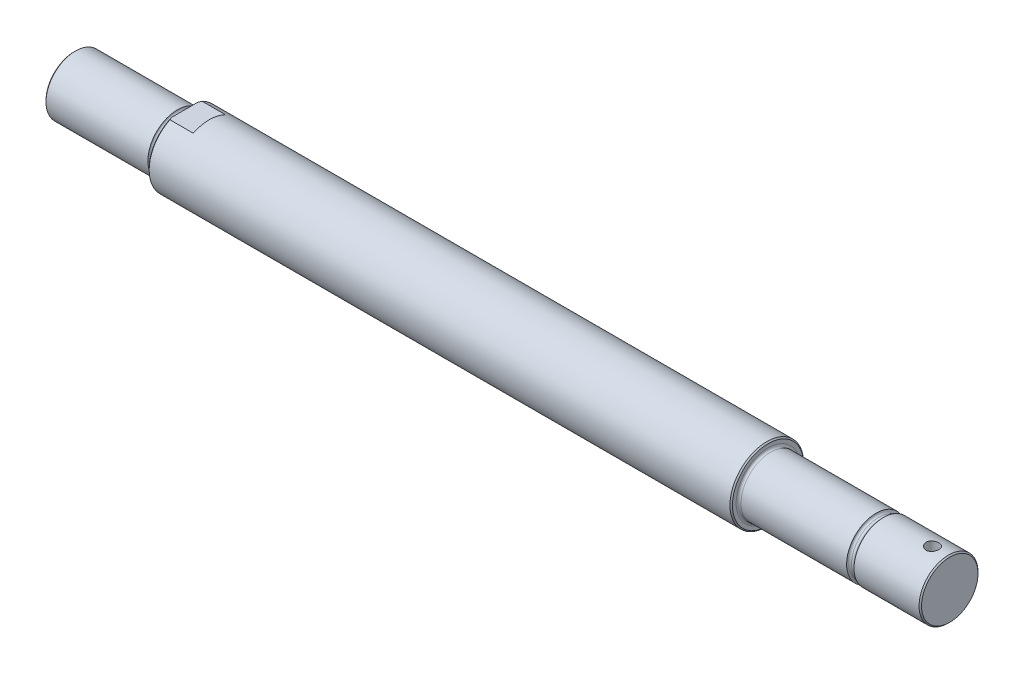
ISO-10303-21;
HEADER;
FILE_DESCRIPTION(('STEP AP214'),'2;1');
FILE_NAME('part.step','',(''),(''),'','','');
FILE_SCHEMA(('AUTOMOTIVE_DESIGN { 1 0 10303 214 1 1 1 1 }'));
ENDSEC;
DATA;
#1=APPLICATION_CONTEXT('core data for automotive mechanical design processes');
#2=APPLICATION_PROTOCOL_DEFINITION('international standard','automotive_design',2000,#1);
#3=PRODUCT_CONTEXT('',#1,'mechanical');
#4=PRODUCT('Part','Part','',(#3));
#5=PRODUCT_RELATED_PRODUCT_CATEGORY('part','',(#4));
#6=PRODUCT_DEFINITION_FORMATION('','',#4);
#7=PRODUCT_DEFINITION_CONTEXT('part definition',#1,'design');
#8=PRODUCT_DEFINITION('design','',#6,#7);
#9=PRODUCT_DEFINITION_SHAPE('','',#8);
#10=(LENGTH_UNIT() NAMED_UNIT(*) SI_UNIT(.MILLI.,.METRE.));
#11=(NAMED_UNIT(*) PLANE_ANGLE_UNIT() SI_UNIT($,.RADIAN.));
#12=(NAMED_UNIT(*) SI_UNIT($,.STERADIAN.) SOLID_ANGLE_UNIT());
#13=UNCERTAINTY_MEASURE_WITH_UNIT(LENGTH_MEASURE(1.E-05),#10,'distance_accuracy_value','');
#14=(GEOMETRIC_REPRESENTATION_CONTEXT(3) GLOBAL_UNCERTAINTY_ASSIGNED_CONTEXT((#13)) GLOBAL_UNIT_ASSIGNED_CONTEXT((#10,
#11,#12)) REPRESENTATION_CONTEXT('',''));
#15=CARTESIAN_POINT('',(0.,0.,0.));
#16=DIRECTION('',(0.,0.,1.));
#17=DIRECTION('',(1.,0.,0.));
#18=AXIS2_PLACEMENT_3D('',#15,#16,#17);
#19=CARTESIAN_POINT('',(-178.25,0.,0.));
#20=DIRECTION('',(-1.,0.,0.));
#21=DIRECTION('',(0.,0.,1.));
#22=AXIS2_PLACEMENT_3D('',#19,#20,#21);
#23=CYLINDRICAL_SURFACE('',#22,15.);
#24=CARTESIAN_POINT('',(103.75,0.,0.));
#25=DIRECTION('',(-1.,0.,0.));
#26=DIRECTION('',(0.,0.,1.));
#27=AXIS2_PLACEMENT_3D('',#24,#25,#26);
#28=CIRCLE('',#27,15.);
#29=CARTESIAN_POINT('',(103.75,0.,15.));
#30=VERTEX_POINT('',#29);
#31=EDGE_CURVE('E192',#30,#30,#28,.T.);
#32=ORIENTED_EDGE('',*,*,#31,.T.);
#33=EDGE_LOOP('',(#32));
#34=FACE_BOUND('',#33,.T.);
#35=DIRECTION('',(-1.,0.,0.));
#36=VECTOR('',#35,1.);
#37=CARTESIAN_POINT('',(-178.25,13.5,6.53834841531101));
#38=LINE('',#37,#36);
#39=CARTESIAN_POINT('',(-123.25,13.5,6.53834841531101));
#40=VERTEX_POINT('',#39);
#41=CARTESIAN_POINT('',(-132.75,13.5,6.53834841531101));
#42=VERTEX_POINT('',#41);
#43=EDGE_CURVE('E352',#40,#42,#38,.T.);
#44=ORIENTED_EDGE('',*,*,#43,.T.);
#45=CARTESIAN_POINT('',(-132.75,0.,0.));
#46=DIRECTION('',(-1.,0.,0.));
#47=DIRECTION('',(0.,0.,1.));
#48=AXIS2_PLACEMENT_3D('',#45,#46,#47);
#49=CIRCLE('',#48,15.);
#50=CARTESIAN_POINT('',(-132.75,-13.5,6.53834841531101));
#51=VERTEX_POINT('',#50);
#52=EDGE_CURVE('E189',#42,#51,#49,.F.);
#53=ORIENTED_EDGE('',*,*,#52,.T.);
#54=DIRECTION('',(-1.,0.,0.));
#55=VECTOR('',#54,1.);
#56=CARTESIAN_POINT('',(-178.25,-13.5,6.53834841531101));
#57=LINE('',#56,#55);
#58=CARTESIAN_POINT('',(-123.25,-13.5,6.53834841531101));
#59=VERTEX_POINT('',#58);
#60=EDGE_CURVE('E130',#59,#51,#57,.T.);
#61=ORIENTED_EDGE('',*,*,#60,.F.);
#62=CARTESIAN_POINT('',(-123.25,0.,0.));
#63=DIRECTION('',(1.,0.,0.));
#64=DIRECTION('',(0.,0.,-1.));
#65=AXIS2_PLACEMENT_3D('',#62,#63,#64);
#66=CIRCLE('',#65,15.);
#67=CARTESIAN_POINT('',(-123.25,-13.5,-6.53834841531101));
#68=VERTEX_POINT('',#67);
#69=EDGE_CURVE('E135',#59,#68,#66,.T.);
#70=ORIENTED_EDGE('',*,*,#69,.T.);
#71=DIRECTION('',(-1.,0.,0.));
#72=VECTOR('',#71,1.);
#73=CARTESIAN_POINT('',(-178.25,-13.5,-6.53834841531101));
#74=LINE('',#73,#72);
#75=CARTESIAN_POINT('',(-132.75,-13.5,-6.53834841531101));
#76=VERTEX_POINT('',#75);
#77=EDGE_CURVE('E116',#76,#68,#74,.F.);
#78=ORIENTED_EDGE('',*,*,#77,.F.);
#79=CARTESIAN_POINT('',(-132.75,0.,0.));
#80=DIRECTION('',(-1.,0.,0.));
#81=DIRECTION('',(0.,0.,1.));
#82=AXIS2_PLACEMENT_3D('',#79,#80,#81);
#83=CIRCLE('',#82,15.);
#84=CARTESIAN_POINT('',(-132.75,13.5,-6.53834841531101));
#85=VERTEX_POINT('',#84);
#86=EDGE_CURVE('E186',#76,#85,#83,.F.);
#87=ORIENTED_EDGE('',*,*,#86,.T.);
#88=DIRECTION('',(-1.,0.,0.));
#89=VECTOR('',#88,1.);
#90=CARTESIAN_POINT('',(-178.25,13.5,-6.53834841531101));
#91=LINE('',#90,#89);
#92=CARTESIAN_POINT('',(-123.25,13.5,-6.53834841531101));
#93=VERTEX_POINT('',#92);
#94=EDGE_CURVE('E408',#85,#93,#91,.F.);
#95=ORIENTED_EDGE('',*,*,#94,.T.);
#96=CARTESIAN_POINT('',(-123.25,0.,0.));
#97=DIRECTION('',(-1.,0.,0.));
#98=DIRECTION('',(0.,0.,1.));
#99=AXIS2_PLACEMENT_3D('',#96,#97,#98);
#100=CIRCLE('',#99,15.);
#101=EDGE_CURVE('E141',#40,#93,#100,.T.);
#102=ORIENTED_EDGE('',*,*,#101,.F.);
#103=EDGE_LOOP('',(#44,#53,#61,#70,#78,#87,#95,#102));
#104=FACE_BOUND('',#103,.T.);
#105=ADVANCED_FACE('F60',(#34,#104),#23,.T.);
#106=CARTESIAN_POINT('',(-133.25,15.,0.));
#107=DIRECTION('',(-1.,0.,0.));
#108=DIRECTION('',(0.,-1.,0.));
#109=AXIS2_PLACEMENT_3D('',#106,#107,#108);
#110=PLANE('',#109);
#111=CARTESIAN_POINT('',(-133.25,0.,0.));
#112=DIRECTION('',(-1.,0.,0.));
#113=DIRECTION('',(0.,-1.,0.));
#114=AXIS2_PLACEMENT_3D('',#111,#112,#113);
#115=CIRCLE('',#114,12.);
#116=CARTESIAN_POINT('',(-133.25,-12.,0.));
#117=VERTEX_POINT('',#116);
#118=EDGE_CURVE('E178',#117,#117,#115,.F.);
#119=ORIENTED_EDGE('',*,*,#118,.T.);
#120=EDGE_LOOP('',(#119));
#121=FACE_BOUND('',#120,.T.);
#122=DIRECTION('',(0.,0.,1.));
#123=VECTOR('',#122,1.);
#124=CARTESIAN_POINT('',(-133.25,-13.5,0.));
#125=LINE('',#124,#123);
#126=CARTESIAN_POINT('',(-133.25,-13.5,-5.29150262212928));
#127=VERTEX_POINT('',#126);
#128=CARTESIAN_POINT('',(-133.25,-13.5,5.29150262212928));
#129=VERTEX_POINT('',#128);
#130=EDGE_CURVE('E151',#127,#129,#125,.T.);
#131=ORIENTED_EDGE('',*,*,#130,.T.);
#132=CARTESIAN_POINT('',(-133.25,0.,0.));
#133=DIRECTION('',(-1.,0.,0.));
#134=DIRECTION('',(0.,-1.,0.));
#135=AXIS2_PLACEMENT_3D('',#132,#133,#134);
#136=CIRCLE('',#135,14.5);
#137=CARTESIAN_POINT('',(-133.25,13.5,5.29150262212928));
#138=VERTEX_POINT('',#137);
#139=EDGE_CURVE('E77',#129,#138,#136,.T.);
#140=ORIENTED_EDGE('',*,*,#139,.T.);
#141=DIRECTION('',(0.,0.,1.));
#142=VECTOR('',#141,1.);
#143=CARTESIAN_POINT('',(-133.25,13.5,0.));
#144=LINE('',#143,#142);
#145=CARTESIAN_POINT('',(-133.25,13.5,-5.29150262212928));
#146=VERTEX_POINT('',#145);
#147=EDGE_CURVE('E142',#146,#138,#144,.T.);
#148=ORIENTED_EDGE('',*,*,#147,.F.);
#149=CARTESIAN_POINT('',(-133.25,0.,0.));
#150=DIRECTION('',(-1.,0.,0.));
#151=DIRECTION('',(0.,-1.,0.));
#152=AXIS2_PLACEMENT_3D('',#149,#150,#151);
#153=CIRCLE('',#152,14.5);
#154=EDGE_CURVE('E394',#146,#127,#153,.T.);
#155=ORIENTED_EDGE('',*,*,#154,.T.);
#156=EDGE_LOOP('',(#131,#140,#148,#155));
#157=FACE_BOUND('',#156,.T.);
#158=ADVANCED_FACE('F260',(#121,#157),#110,.T.);
#159=CARTESIAN_POINT('',(178.25,0.,0.));
#160=DIRECTION('',(1.,0.,0.));
#161=DIRECTION('',(0.,1.,0.));
#162=AXIS2_PLACEMENT_3D('',#159,#160,#161);
#163=CYLINDRICAL_SURFACE('',#162,12.);
#164=CARTESIAN_POINT('',(177.75,0.,0.));
#165=DIRECTION('',(-1.,0.,0.));
#166=DIRECTION('',(0.,-1.,0.));
#167=AXIS2_PLACEMENT_3D('',#164,#165,#166);
#168=CIRCLE('',#167,12.);
#169=CARTESIAN_POINT('',(177.75,-12.,0.));
#170=VERTEX_POINT('',#169);
#171=EDGE_CURVE('E200',#170,#170,#168,.T.);
#172=ORIENTED_EDGE('',*,*,#171,.T.);
#173=EDGE_LOOP('',(#172));
#174=FACE_BOUND('',#173,.T.);
#175=CARTESIAN_POINT('',(168.65,12.,0.));
#176=CARTESIAN_POINT('',(168.650004972303,11.9999973354446,0.144236726439558));
#177=CARTESIAN_POINT('',(168.662042967354,11.9973730147826,0.288533845639436));
#178=CARTESIAN_POINT('',(168.709828238634,11.9871575196756,0.573031652658618));
#179=CARTESIAN_POINT('',(168.745592673061,11.9795627508158,0.713229299208326));
#180=CARTESIAN_POINT('',(168.839659865051,11.9602522565868,0.985375249675098));
#181=CARTESIAN_POINT('',(168.897939301033,11.9485407965133,1.11733192602807));
#182=CARTESIAN_POINT('',(169.035308673135,11.9222619563313,1.3695890486345));
#183=CARTESIAN_POINT('',(169.114397991646,11.9076946609835,1.4898898406743));
#184=CARTESIAN_POINT('',(169.292461597268,11.8770440902161,1.71732166523923));
#185=CARTESIAN_POINT('',(169.391700998679,11.8609423068128,1.82424265549683));
#186=CARTESIAN_POINT('',(169.606678488386,11.8291684195956,2.02005881340805));
#187=CARTESIAN_POINT('',(169.722418024412,11.8134963536293,2.1089523976706));
#188=CARTESIAN_POINT('',(169.968658566674,11.7841740733055,2.26711337737444));
#189=CARTESIAN_POINT('',(170.099305825496,11.7705475862121,2.33615786385217));
#190=CARTESIAN_POINT('',(170.37069243936,11.7471246428021,2.45123108596793));
#191=CARTESIAN_POINT('',(170.51143060977,11.7373277377766,2.49726251820138));
#192=CARTESIAN_POINT('',(170.796727639718,11.7228615532269,2.56431019661689));
#193=CARTESIAN_POINT('',(170.941195252538,11.7181162066326,2.58569794861031));
#194=CARTESIAN_POINT('',(171.231740095497,11.714061911669,2.60400615804867));
#195=CARTESIAN_POINT('',(171.377817129506,11.71475230804,2.60092956458315));
#196=CARTESIAN_POINT('',(171.664677398804,11.7214225988847,2.57069554242108));
#197=CARTESIAN_POINT('',(171.805508585277,11.7273078350462,2.54396903156786));
#198=CARTESIAN_POINT('',(172.080639595153,11.7435550978599,2.46787625956813));
#199=CARTESIAN_POINT('',(172.214939057839,11.7539173714466,2.41850874963034));
#200=CARTESIAN_POINT('',(172.474409227574,11.7780448194994,2.29813787328689));
#201=CARTESIAN_POINT('',(172.599500280537,11.7918359866955,2.22696823220314));
#202=CARTESIAN_POINT('',(172.836124048607,11.8212512787303,2.065130298781));
#203=CARTESIAN_POINT('',(172.947654945252,11.8368756488568,1.9744593957635));
#204=CARTESIAN_POINT('',(173.156474019979,11.8686034657252,1.77390871521164));
#205=CARTESIAN_POINT('',(173.253409997498,11.8847100454316,1.66366235662348));
#206=CARTESIAN_POINT('',(173.427473894395,11.9152855453676,1.42829655036696));
#207=CARTESIAN_POINT('',(173.504601467898,11.9297544369989,1.30317684305031));
#208=CARTESIAN_POINT('',(173.636943705019,11.9554698973281,1.04119055177431));
#209=CARTESIAN_POINT('',(173.692112890846,11.9667097651791,0.904300295205736));
#210=CARTESIAN_POINT('',(173.77856861265,11.9846508353724,0.622894974848423));
#211=CARTESIAN_POINT('',(173.80985855501,11.9913526850491,0.478381001731169));
#212=CARTESIAN_POINT('',(173.847156868924,11.999370689196,0.188852168823129));
#213=CARTESIAN_POINT('',(173.853646449489,12.0007893411299,0.0439020574477344));
#214=CARTESIAN_POINT('',(173.842463167102,11.9983680429883,-0.245011114222886));
#215=CARTESIAN_POINT('',(173.824791910674,11.9945284425492,-0.388974239506001));
#216=CARTESIAN_POINT('',(173.766187693156,11.9820866849589,-0.670237247334901));
#217=CARTESIAN_POINT('',(173.725506502814,11.9735361004107,-0.807592072456823));
#218=CARTESIAN_POINT('',(173.622316167325,11.9526291720798,-1.0735286997633));
#219=CARTESIAN_POINT('',(173.559805186749,11.9402725082958,-1.20210976317082));
#220=CARTESIAN_POINT('',(173.413722739961,11.9128709234998,-1.44884325605772));
#221=CARTESIAN_POINT('',(173.329867778462,11.8977906795577,-1.56682382807616));
#222=CARTESIAN_POINT('',(173.143851729171,11.8666879962894,-1.78721154382001));
#223=CARTESIAN_POINT('',(173.041688311542,11.8506654372236,-1.88961670243109));
#224=CARTESIAN_POINT('',(172.819749150625,11.8191309043505,-2.07784405093427));
#225=CARTESIAN_POINT('',(172.699688642265,11.8036333783503,-2.16333333925308));
#226=CARTESIAN_POINT('',(172.446631314418,11.775234476741,-2.31293638979139));
#227=CARTESIAN_POINT('',(172.313635051273,11.7623329895541,-2.37705107076864));
#228=CARTESIAN_POINT('',(172.039191143534,11.7407086018304,-2.48165614660999));
#229=CARTESIAN_POINT('',(171.897795682338,11.7319624281802,-2.52227840324693));
#230=CARTESIAN_POINT('',(171.609972351161,11.7195960803086,-2.57913351826821));
#231=CARTESIAN_POINT('',(171.463545272258,11.7159751040391,-2.59537019280476));
#232=CARTESIAN_POINT('',(171.173170103694,11.7143189953347,-2.60283320848537));
#233=CARTESIAN_POINT('',(171.029235994595,11.7161660225572,-2.59458716285149));
#234=CARTESIAN_POINT('',(170.744860265962,11.7249716694698,-2.55449661594729));
#235=CARTESIAN_POINT('',(170.60441860688,11.7319302312494,-2.52265238203));
#236=CARTESIAN_POINT('',(170.331424000623,11.7501179820486,-2.43652213110985));
#237=CARTESIAN_POINT('',(170.198846241061,11.7613328104136,-2.38231152530464));
#238=CARTESIAN_POINT('',(169.944588721284,11.786775368259,-2.25305267013939));
#239=CARTESIAN_POINT('',(169.822910073498,11.8010034047887,-2.1780022969411));
#240=CARTESIAN_POINT('',(169.591300835105,11.8312222292587,-2.00743837935343));
#241=CARTESIAN_POINT('',(169.481651360132,11.8472423996664,-1.91154824147324));
#242=CARTESIAN_POINT('',(169.279826560398,11.8790414924123,-1.70279162388225));
#243=CARTESIAN_POINT('',(169.187655276868,11.8948203581836,-1.58992122886305));
#244=CARTESIAN_POINT('',(169.022286252632,11.9245960952928,-1.34868418142398));
#245=CARTESIAN_POINT('',(168.949343857588,11.9385678399551,-1.22013921864495));
#246=CARTESIAN_POINT('',(168.826215648375,11.9629036221577,-0.952339105556219));
#247=CARTESIAN_POINT('',(168.776010585299,11.9732707095849,-0.813093131747958));
#248=CARTESIAN_POINT('',(168.70881884729,11.9873604762337,-0.561406270703276));
#249=CARTESIAN_POINT('',(168.686803544831,11.9920711259945,-0.450335585529251));
#250=CARTESIAN_POINT('',(168.657392484021,11.9983918663936,-0.226188923413986));
#251=CARTESIAN_POINT('',(168.64999610063,12.0000020895922,-0.113113032414969));
#252=CARTESIAN_POINT('',(168.65,12.,0.));
#253=B_SPLINE_CURVE_WITH_KNOTS('',3,(#175,#176,#177,#178,#179,#180,#181,#182,#183,#184,#185,
#186,#187,#188,#189,#190,#191,#192,#193,#194,#195,#196,#197,#198,#199,#200,#201,#202,#203,#204,
#205,#206,#207,#208,#209,#210,#211,#212,#213,#214,#215,#216,#217,#218,#219,#220,#221,#222,#223,
#224,#225,#226,#227,#228,#229,#230,#231,#232,#233,#234,#235,#236,#237,#238,#239,#240,#241,#242,
#243,#244,#245,#246,#247,#248,#249,#250,#251,#252),.UNSPECIFIED.,.T.,.F.,(4,2,2,2,2,2,2,2,2,2,2,
2,2,2,2,2,2,2,2,2,2,2,2,2,2,2,2,2,2,2,2,2,2,2,2,2,2,2,4),(0.,0.432296167596458,
0.864905299162181,1.2970675200411,1.72921691636088,2.16747088004792,2.60576331999454,
3.04880106599835,3.49178688609447,3.92800348668547,4.36416750371916,4.7925442862594,
5.22094469927376,5.65269728196235,6.08450770038595,6.52547542392672,6.9664508466975,
7.40833487520641,7.85015585701494,8.28335919264328,8.71653372472676,9.1450577634168,
9.57361784070126,10.0081977504593,10.4428330018757,10.885318030012,11.3277840360924,
11.767741776118,12.2076306590336,12.6381090344705,13.0685825329256,13.4976163421279,
13.9266938914079,14.364287920262,14.8019830046558,15.2452268636413,15.6880947778048,
16.0271236952943,16.366138117108),.UNSPECIFIED.);
#254=CARTESIAN_POINT('',(168.65,12.,0.));
#255=VERTEX_POINT('',#254);
#256=EDGE_CURVE('E330',#255,#255,#253,.T.);
#257=ORIENTED_EDGE('',*,*,#256,.F.);
#258=EDGE_LOOP('',(#257));
#259=FACE_BOUND('',#258,.T.);
#260=CARTESIAN_POINT('',(171.25,-11.714947716486,2.59999999999999));
#261=CARTESIAN_POINT('',(171.105808071027,-11.7149506300318,2.59999499534854));
#262=CARTESIAN_POINT('',(170.961555668416,-11.7176388577269,2.58796422285042));
#263=CARTESIAN_POINT('',(170.677150686029,-11.7280820029083,2.54021023721584));
#264=CARTESIAN_POINT('',(170.537001184745,-11.7358406279201,2.50446968696193));
#265=CARTESIAN_POINT('',(170.264957242693,-11.7555055486852,2.41047231141574));
#266=CARTESIAN_POINT('',(170.133054021162,-11.7674073408381,2.35223992712881));
#267=CARTESIAN_POINT('',(169.880887156447,-11.7940121510493,2.21498149637594));
#268=CARTESIAN_POINT('',(169.760623227204,-11.8087151002375,2.13595596111855));
#269=CARTESIAN_POINT('',(169.53315267133,-11.8395378925012,1.9579579997251));
#270=CARTESIAN_POINT('',(169.426167097344,-11.8556755712714,1.85870612184275));
#271=CARTESIAN_POINT('',(169.230225467065,-11.8873932725662,1.6436761932946));
#272=CARTESIAN_POINT('',(169.14127079599,-11.90297325217,1.52789687407801));
#273=CARTESIAN_POINT('',(168.983043558656,-11.9320141366661,1.28161861627877));
#274=CARTESIAN_POINT('',(168.91398331399,-11.9454515442086,1.15098025766276));
#275=CARTESIAN_POINT('',(168.798878539532,-11.9684919123295,0.879612849767246));
#276=CARTESIAN_POINT('',(168.75283147631,-11.978095294957,0.738884913160428));
#277=CARTESIAN_POINT('',(168.685754606161,-11.9922595380826,0.453631049271671));
#278=CARTESIAN_POINT('',(168.664350773055,-11.9968957117097,0.309196876165756));
#279=CARTESIAN_POINT('',(168.645998797252,-12.0008640083932,0.0187183852466907));
#280=CARTESIAN_POINT('',(168.649047907106,-12.0001967273276,-0.127325749835409));
#281=CARTESIAN_POINT('',(168.679236113251,-11.9936909484855,-0.414301026380135));
#282=CARTESIAN_POINT('',(168.705972087125,-11.9879389895303,-0.555276824288542));
#283=CARTESIAN_POINT('',(168.782133037528,-11.972008636555,-0.830692063804934));
#284=CARTESIAN_POINT('',(168.83155902721,-11.9618300448781,-0.965131213242443));
#285=CARTESIAN_POINT('',(168.952055481834,-11.9380505435059,-1.2247795133764));
#286=CARTESIAN_POINT('',(169.023279335575,-11.924425503437,-1.34991517963826));
#287=CARTESIAN_POINT('',(169.185235455801,-11.8952479893853,-1.58660567091394));
#288=CARTESIAN_POINT('',(169.275970333295,-11.8796952575525,-1.69815867513289));
#289=CARTESIAN_POINT('',(169.476569499688,-11.8479985747637,-1.9069142433668));
#290=CARTESIAN_POINT('',(169.586786607313,-11.831849036322,-2.00377721909876));
#291=CARTESIAN_POINT('',(169.822066863526,-11.8010768696216,-2.17770734206601));
#292=CARTESIAN_POINT('',(169.947130399308,-11.7864542812042,-2.25477397284819));
#293=CARTESIAN_POINT('',(170.209095441474,-11.7603772959716,-2.38707079423466));
#294=CARTESIAN_POINT('',(170.3460298026,-11.7489320859654,-2.44223785994898));
#295=CARTESIAN_POINT('',(170.6275318274,-11.7306337989501,-2.52867613095888));
#296=CARTESIAN_POINT('',(170.77209830153,-11.7237800085877,-2.55995104840176));
#297=CARTESIAN_POINT('',(171.06166074473,-11.7155857757038,-2.59719269835716));
#298=CARTESIAN_POINT('',(171.206590207231,-11.714137731798,-2.60365343331652));
#299=CARTESIAN_POINT('',(171.49545541092,-11.7166288478047,-2.59241985028292));
#300=CARTESIAN_POINT('',(171.639391218338,-11.7205676451107,-2.57472715813842));
#301=CARTESIAN_POINT('',(171.92047001659,-11.733287126794,-2.51611725451019));
#302=CARTESIAN_POINT('',(172.057672344591,-11.7420112458403,-2.47547120265603));
#303=CARTESIAN_POINT('',(172.32331934446,-11.7632675177894,-2.37240155419931));
#304=CARTESIAN_POINT('',(172.451763189693,-11.7758000295249,-2.30997590540734));
#305=CARTESIAN_POINT('',(172.698387696241,-11.8034980027527,-2.16402732754586));
#306=CARTESIAN_POINT('',(172.816383709872,-11.818700425937,-2.08019953748662));
#307=CARTESIAN_POINT('',(173.036815015652,-11.8499273689652,-1.89422599437251));
#308=CARTESIAN_POINT('',(173.139248410603,-11.8659519887228,-1.79207801125626));
#309=CARTESIAN_POINT('',(173.327559160709,-11.8973718264988,-1.57013026191641));
#310=CARTESIAN_POINT('',(173.413100033166,-11.9127502076758,-1.45004222260283));
#311=CARTESIAN_POINT('',(173.562793541039,-11.940837013015,-1.19691389957492));
#312=CARTESIAN_POINT('',(173.626947165099,-11.9535455605824,-1.06387421492847));
#313=CARTESIAN_POINT('',(173.731573988276,-11.974789690183,-0.789439876043639));
#314=CARTESIAN_POINT('',(173.77219556423,-11.9833513621378,-0.648103900948665));
#315=CARTESIAN_POINT('',(173.829069385307,-11.995449777427,-0.360407832534539));
#316=CARTESIAN_POINT('',(173.845325103092,-11.998987236817,-0.214048458200629));
#317=CARTESIAN_POINT('',(173.852852086312,-12.0006178834246,0.0763433045858422));
#318=CARTESIAN_POINT('',(173.844626123566,-11.9988206298237,0.220362276509854));
#319=CARTESIAN_POINT('',(173.804546194341,-11.9902180245313,0.504913147396077));
#320=CARTESIAN_POINT('',(173.772692637191,-11.9834127595998,0.645445106724526));
#321=CARTESIAN_POINT('',(173.68650073582,-11.9655663169557,0.918652480291166));
#322=CARTESIAN_POINT('',(173.632232467616,-11.9545383486205,1.05135091995898));
#323=CARTESIAN_POINT('',(173.502820428586,-11.9294252118726,1.30582634329755));
#324=CARTESIAN_POINT('',(173.427674672628,-11.9153397527671,1.42760228694812));
#325=CARTESIAN_POINT('',(173.25699491074,-11.8853211156753,1.65923226441778));
#326=CARTESIAN_POINT('',(173.161106630302,-11.8693583641116,1.76882143805988));
#327=CARTESIAN_POINT('',(172.952379890983,-11.8375453740579,1.97052545166515));
#328=CARTESIAN_POINT('',(172.839537361588,-11.8216951635473,2.06263608318612));
#329=CARTESIAN_POINT('',(172.598332728296,-11.7916713632252,2.22792599963229));
#330=CARTESIAN_POINT('',(172.469787123146,-11.7775223839328,2.30084222447145));
#331=CARTESIAN_POINT('',(172.20198849329,-11.7528114262808,2.42392133822828));
#332=CARTESIAN_POINT('',(172.062744724967,-11.7422463889105,2.4741036436211));
#333=CARTESIAN_POINT('',(171.81111539032,-11.7278707536719,2.54124250613355));
#334=CARTESIAN_POINT('',(171.700103257723,-11.7230565314123,2.56323463936517));
#335=CARTESIAN_POINT('',(171.476073079218,-11.716593944907,2.59261500559942));
#336=CARTESIAN_POINT('',(171.363055127697,-11.7149454320912,2.60000392394714));
#337=CARTESIAN_POINT('',(171.25,-11.714947716486,2.59999999999999));
#338=B_SPLINE_CURVE_WITH_KNOTS('',3,(#260,#261,#262,#263,#264,#265,#266,#267,#268,#269,#270,
#271,#272,#273,#274,#275,#276,#277,#278,#279,#280,#281,#282,#283,#284,#285,#286,#287,#288,#289,
#290,#291,#292,#293,#294,#295,#296,#297,#298,#299,#300,#301,#302,#303,#304,#305,#306,#307,#308,
#309,#310,#311,#312,#313,#314,#315,#316,#317,#318,#319,#320,#321,#322,#323,#324,#325,#326,#327,
#328,#329,#330,#331,#332,#333,#334,#335,#336,#337),.UNSPECIFIED.,.T.,.F.,(4,2,2,2,2,2,2,2,2,2,2,
2,2,2,2,2,2,2,2,2,2,2,2,2,2,2,2,2,2,2,2,2,2,2,2,2,2,2,4),(0.,0.432161493823311,
0.864639342588248,1.29664855063133,1.72864713853472,2.16707728816394,2.60554110726698,
3.04852433811462,3.49145879195404,3.92757804331551,4.36364829451038,4.79243672630817,
5.22124430620132,5.65314157085296,6.08509666897972,6.5258731429471,6.9666611148584,
7.40871057726847,7.85069134402905,8.28382608870744,8.71693167906617,9.14502470737239,
9.57315808377848,10.0077679909162,10.4424308377473,10.8850309556059,11.3276106110721,
11.7673684074966,12.2070635229448,12.6377914980314,13.0685120112597,13.4978960173905,
13.9273208653775,14.3647586634598,14.8023016535098,15.2455611281641,15.6884413088886,
16.0272977646138,16.3661383170514),.UNSPECIFIED.);
#339=CARTESIAN_POINT('',(171.25,-11.714947716486,2.59999999999999));
#340=VERTEX_POINT('',#339);
#341=EDGE_CURVE('E334',#340,#340,#338,.T.);
#342=ORIENTED_EDGE('',*,*,#341,.F.);
#343=EDGE_LOOP('',(#342));
#344=FACE_BOUND('',#343,.T.);
#345=CARTESIAN_POINT('',(151.25,0.,0.));
#346=DIRECTION('',(-1.,0.,0.));
#347=DIRECTION('',(0.,-1.,0.));
#348=AXIS2_PLACEMENT_3D('',#345,#346,#347);
#349=CIRCLE('',#348,12.);
#350=CARTESIAN_POINT('',(151.25,-12.,0.));
#351=VERTEX_POINT('',#350);
#352=EDGE_CURVE('E337',#351,#351,#349,.F.);
#353=ORIENTED_EDGE('',*,*,#352,.T.);
#354=EDGE_LOOP('',(#353));
#355=FACE_BOUND('',#354,.T.);
#356=ADVANCED_FACE('F268',(#174,#259,#344,#355),#163,.T.);
#357=CARTESIAN_POINT('',(105.25,0.,0.));
#358=DIRECTION('',(-1.,0.,0.));
#359=DIRECTION('',(0.,-1.,0.));
#360=AXIS2_PLACEMENT_3D('',#357,#358,#359);
#361=CIRCLE('',#360,12.);
#362=CARTESIAN_POINT('',(105.25,-12.,0.));
#363=VERTEX_POINT('',#362);
#364=EDGE_CURVE('E162',#363,#363,#361,.F.);
#365=ORIENTED_EDGE('',*,*,#364,.T.);
#366=EDGE_LOOP('',(#365));
#367=FACE_BOUND('',#366,.T.);
#368=CARTESIAN_POINT('',(148.25,0.,0.));
#369=DIRECTION('',(-1.,0.,0.));
#370=DIRECTION('',(0.,-1.,0.));
#371=AXIS2_PLACEMENT_3D('',#368,#369,#370);
#372=CIRCLE('',#371,12.);
#373=CARTESIAN_POINT('',(148.25,-12.,0.));
#374=VERTEX_POINT('',#373);
#375=EDGE_CURVE('E340',#374,#374,#372,.F.);
#376=ORIENTED_EDGE('',*,*,#375,.F.);
#377=EDGE_LOOP('',(#376));
#378=FACE_BOUND('',#377,.T.);
#379=ADVANCED_FACE('F325',(#367,#378),#163,.T.);
#380=CARTESIAN_POINT('',(104.25,15.,0.));
#381=DIRECTION('',(-1.,0.,0.));
#382=DIRECTION('',(0.,-1.,0.));
#383=AXIS2_PLACEMENT_3D('',#380,#381,#382);
#384=PLANE('',#383);
#385=CARTESIAN_POINT('',(104.25,0.,0.));
#386=DIRECTION('',(-1.,0.,0.));
#387=DIRECTION('',(0.,-1.,0.));
#388=AXIS2_PLACEMENT_3D('',#385,#386,#387);
#389=CIRCLE('',#388,14.5000000000001);
#390=CARTESIAN_POINT('',(104.25,-14.5000000000001,0.));
#391=VERTEX_POINT('',#390);
#392=EDGE_CURVE('E182',#391,#391,#389,.F.);
#393=ORIENTED_EDGE('',*,*,#392,.T.);
#394=EDGE_LOOP('',(#393));
#395=FACE_BOUND('',#394,.T.);
#396=CARTESIAN_POINT('',(104.25,0.,0.));
#397=DIRECTION('',(-1.,0.,0.));
#398=DIRECTION('',(0.,-1.,0.));
#399=AXIS2_PLACEMENT_3D('',#396,#397,#398);
#400=CIRCLE('',#399,13.);
#401=CARTESIAN_POINT('',(104.25,-13.,0.));
#402=VERTEX_POINT('',#401);
#403=EDGE_CURVE('E166',#402,#402,#400,.T.);
#404=ORIENTED_EDGE('',*,*,#403,.T.);
#405=EDGE_LOOP('',(#404));
#406=FACE_BOUND('',#405,.T.);
#407=ADVANCED_FACE('F370',(#395,#406),#384,.F.);
#408=CARTESIAN_POINT('',(178.25,0.,0.));
#409=DIRECTION('',(1.,0.,0.));
#410=DIRECTION('',(0.,1.,0.));
#411=AXIS2_PLACEMENT_3D('',#408,#409,#410);
#412=CYLINDRICAL_SURFACE('',#411,11.);
#413=CARTESIAN_POINT('',(150.25,0.,0.));
#414=DIRECTION('',(-1.,0.,0.));
#415=DIRECTION('',(0.,-1.,0.));
#416=AXIS2_PLACEMENT_3D('',#413,#414,#415);
#417=CIRCLE('',#416,11.);
#418=CARTESIAN_POINT('',(150.25,-11.,0.));
#419=VERTEX_POINT('',#418);
#420=EDGE_CURVE('E158',#419,#419,#417,.T.);
#421=ORIENTED_EDGE('',*,*,#420,.T.);
#422=EDGE_LOOP('',(#421));
#423=FACE_BOUND('',#422,.T.);
#424=CARTESIAN_POINT('',(149.25,0.,0.));
#425=DIRECTION('',(-1.,0.,0.));
#426=DIRECTION('',(0.,-1.,0.));
#427=AXIS2_PLACEMENT_3D('',#424,#425,#426);
#428=CIRCLE('',#427,11.);
#429=CARTESIAN_POINT('',(149.25,-11.,0.));
#430=VERTEX_POINT('',#429);
#431=EDGE_CURVE('E149',#430,#430,#428,.F.);
#432=ORIENTED_EDGE('',*,*,#431,.T.);
#433=EDGE_LOOP('',(#432));
#434=FACE_BOUND('',#433,.T.);
#435=ADVANCED_FACE('F271',(#423,#434),#412,.T.);
#436=CARTESIAN_POINT('',(178.25,0.,0.));
#437=DIRECTION('',(1.,0.,0.));
#438=DIRECTION('',(0.,1.,0.));
#439=AXIS2_PLACEMENT_3D('',#436,#437,#438);
#440=CYLINDRICAL_SURFACE('',#439,12.);
#441=CARTESIAN_POINT('',(-177.75,0.,0.));
#442=DIRECTION('',(1.,0.,0.));
#443=DIRECTION('',(0.,1.,0.));
#444=AXIS2_PLACEMENT_3D('',#441,#442,#443);
#445=CIRCLE('',#444,12.);
#446=CARTESIAN_POINT('',(-177.75,12.,0.));
#447=VERTEX_POINT('',#446);
#448=EDGE_CURVE('E70',#447,#447,#445,.T.);
#449=ORIENTED_EDGE('',*,*,#448,.T.);
#450=EDGE_LOOP('',(#449));
#451=FACE_BOUND('',#450,.T.);
#452=CARTESIAN_POINT('',(-136.25,0.,0.));
#453=DIRECTION('',(-1.,0.,0.));
#454=DIRECTION('',(0.,-1.,0.));
#455=AXIS2_PLACEMENT_3D('',#452,#453,#454);
#456=CIRCLE('',#455,12.);
#457=CARTESIAN_POINT('',(-136.25,-12.,0.));
#458=VERTEX_POINT('',#457);
#459=EDGE_CURVE('E341',#458,#458,#456,.T.);
#460=ORIENTED_EDGE('',*,*,#459,.T.);
#461=EDGE_LOOP('',(#460));
#462=FACE_BOUND('',#461,.T.);
#463=ADVANCED_FACE('F280',(#451,#462),#440,.T.);
#464=CARTESIAN_POINT('',(178.25,0.,0.));
#465=DIRECTION('',(1.,0.,0.));
#466=DIRECTION('',(0.,1.,0.));
#467=AXIS2_PLACEMENT_3D('',#464,#465,#466);
#468=CYLINDRICAL_SURFACE('',#467,11.);
#469=CARTESIAN_POINT('',(-135.25,0.,0.));
#470=DIRECTION('',(-1.,0.,0.));
#471=DIRECTION('',(0.,-1.,0.));
#472=AXIS2_PLACEMENT_3D('',#469,#470,#471);
#473=CIRCLE('',#472,11.);
#474=CARTESIAN_POINT('',(-135.25,-11.,0.));
#475=VERTEX_POINT('',#474);
#476=EDGE_CURVE('E174',#475,#475,#473,.F.);
#477=ORIENTED_EDGE('',*,*,#476,.T.);
#478=EDGE_LOOP('',(#477));
#479=FACE_BOUND('',#478,.T.);
#480=CARTESIAN_POINT('',(-134.25,0.,0.));
#481=DIRECTION('',(-1.,0.,0.));
#482=DIRECTION('',(0.,-1.,0.));
#483=AXIS2_PLACEMENT_3D('',#480,#481,#482);
#484=CIRCLE('',#483,11.);
#485=CARTESIAN_POINT('',(-134.25,-11.,0.));
#486=VERTEX_POINT('',#485);
#487=EDGE_CURVE('E170',#486,#486,#484,.T.);
#488=ORIENTED_EDGE('',*,*,#487,.T.);
#489=EDGE_LOOP('',(#488));
#490=FACE_BOUND('',#489,.T.);
#491=ADVANCED_FACE('F278',(#479,#490),#468,.T.);
#492=CARTESIAN_POINT('',(178.25,15.,0.));
#493=DIRECTION('',(-1.,0.,0.));
#494=DIRECTION('',(0.,0.,1.));
#495=AXIS2_PLACEMENT_3D('',#492,#493,#494);
#496=PLANE('',#495);
#497=CARTESIAN_POINT('',(178.25,0.,0.));
#498=DIRECTION('',(-1.,0.,0.));
#499=DIRECTION('',(0.,0.,1.));
#500=AXIS2_PLACEMENT_3D('',#497,#498,#499);
#501=CIRCLE('',#500,11.5);
#502=CARTESIAN_POINT('',(178.25,0.,11.5));
#503=VERTEX_POINT('',#502);
#504=EDGE_CURVE('E196',#503,#503,#501,.F.);
#505=ORIENTED_EDGE('',*,*,#504,.T.);
#506=EDGE_LOOP('',(#505));
#507=FACE_BOUND('',#506,.T.);
#508=ADVANCED_FACE('F274',(#507),#496,.F.);
#509=CARTESIAN_POINT('',(-178.25,15.,0.));
#510=DIRECTION('',(1.,0.,0.));
#511=DIRECTION('',(0.,0.,-1.));
#512=AXIS2_PLACEMENT_3D('',#509,#510,#511);
#513=PLANE('',#512);
#514=CARTESIAN_POINT('',(-178.25,0.,0.));
#515=DIRECTION('',(1.,0.,0.));
#516=DIRECTION('',(0.,0.,-1.));
#517=AXIS2_PLACEMENT_3D('',#514,#515,#516);
#518=CIRCLE('',#517,11.4999999999999);
#519=CARTESIAN_POINT('',(-178.25,0.,-11.4999999999999));
#520=VERTEX_POINT('',#519);
#521=EDGE_CURVE('E11',#520,#520,#518,.F.);
#522=ORIENTED_EDGE('',*,*,#521,.T.);
#523=EDGE_LOOP('',(#522));
#524=FACE_BOUND('',#523,.T.);
#525=ADVANCED_FACE('F277',(#524),#513,.F.);
#526=CARTESIAN_POINT('',(171.25,-15.,0.));
#527=DIRECTION('',(0.,1.,0.));
#528=DIRECTION('',(0.,0.,1.));
#529=AXIS2_PLACEMENT_3D('',#526,#527,#528);
#530=CYLINDRICAL_SURFACE('',#529,2.59999999999999);
#531=ORIENTED_EDGE('',*,*,#256,.T.);
#532=EDGE_LOOP('',(#531));
#533=FACE_BOUND('',#532,.T.);
#534=ORIENTED_EDGE('',*,*,#341,.T.);
#535=EDGE_LOOP('',(#534));
#536=FACE_BOUND('',#535,.T.);
#537=ADVANCED_FACE('F283',(#533,#536),#530,.F.);
#538=CARTESIAN_POINT('',(-123.25,-15.,-15.));
#539=DIRECTION('',(1.,0.,0.));
#540=DIRECTION('',(0.,0.,-1.));
#541=AXIS2_PLACEMENT_3D('',#538,#539,#540);
#542=PLANE('',#541);
#543=DIRECTION('',(0.,0.,1.));
#544=VECTOR('',#543,1.);
#545=CARTESIAN_POINT('',(-123.25,-13.5,-15.));
#546=LINE('',#545,#544);
#547=EDGE_CURVE('E120',#68,#59,#546,.T.);
#548=ORIENTED_EDGE('',*,*,#547,.F.);
#549=ORIENTED_EDGE('',*,*,#69,.F.);
#550=EDGE_LOOP('',(#548,#549));
#551=FACE_BOUND('',#550,.T.);
#552=ADVANCED_FACE('F134',(#551),#542,.F.);
#553=CARTESIAN_POINT('',(-133.25,-13.5,-15.));
#554=DIRECTION('',(0.,-1.,0.));
#555=DIRECTION('',(0.,0.,-1.));
#556=AXIS2_PLACEMENT_3D('',#553,#554,#555);
#557=PLANE('',#556);
#558=ORIENTED_EDGE('',*,*,#60,.T.);
#559=CARTESIAN_POINT('',(-132.75,-13.5,6.53834841531101));
#560=CARTESIAN_POINT('',(-132.794743033035,-13.5,6.4357000597834));
#561=CARTESIAN_POINT('',(-132.838769882802,-13.5,6.33273833422771));
#562=CARTESIAN_POINT('',(-132.92530385203,-13.5,6.12620667940886));
#563=CARTESIAN_POINT('',(-132.967811323942,-13.5,6.02263689777206));
#564=CARTESIAN_POINT('',(-133.051240684097,-13.5,5.81485838225757));
#565=CARTESIAN_POINT('',(-133.092162551666,-13.5,5.71064964006873));
#566=CARTESIAN_POINT('',(-133.172348150164,-13.5,5.50156845042861));
#567=CARTESIAN_POINT('',(-133.211611491594,-13.5,5.39669585365019));
#568=CARTESIAN_POINT('',(-133.25,-13.5,5.29150262212928));
#569=B_SPLINE_CURVE_WITH_KNOTS('',3,(#559,#560,#561,#562,#563,#564,#565,#566,#567,#568),
.UNSPECIFIED.,.F.,.F.,(4,2,2,2,4),(0.,0.335926843185571,0.671775248950015,1.00762803250515,
1.34355925606216),.UNSPECIFIED.);
#570=EDGE_CURVE('E211',#51,#129,#569,.T.);
#571=ORIENTED_EDGE('',*,*,#570,.T.);
#572=ORIENTED_EDGE('',*,*,#130,.F.);
#573=CARTESIAN_POINT('',(-133.25,-13.5,-5.29150262212928));
#574=CARTESIAN_POINT('',(-133.211611491594,-13.5,-5.3966958536502));
#575=CARTESIAN_POINT('',(-133.172348150164,-13.5,-5.50156845042861));
#576=CARTESIAN_POINT('',(-133.092162551666,-13.5,-5.71064964006873));
#577=CARTESIAN_POINT('',(-133.051240684097,-13.5,-5.81485838225757));
#578=CARTESIAN_POINT('',(-132.967811323942,-13.5,-6.02263689777206));
#579=CARTESIAN_POINT('',(-132.92530385203,-13.5,-6.12620667940886));
#580=CARTESIAN_POINT('',(-132.838769882802,-13.5,-6.33273833422771));
#581=CARTESIAN_POINT('',(-132.794743033035,-13.5,-6.43570005978341));
#582=CARTESIAN_POINT('',(-132.75,-13.5,-6.53834841531101));
#583=B_SPLINE_CURVE_WITH_KNOTS('',3,(#573,#574,#575,#576,#577,#578,#579,#580,#581,#582),
.UNSPECIFIED.,.F.,.F.,(4,2,2,2,4),(0.,0.335931223557017,0.671784007112149,1.00763241287659,
1.34355925606216),.UNSPECIFIED.);
#584=EDGE_CURVE('E124',#127,#76,#583,.T.);
#585=ORIENTED_EDGE('',*,*,#584,.T.);
#586=ORIENTED_EDGE('',*,*,#77,.T.);
#587=ORIENTED_EDGE('',*,*,#547,.T.);
#588=EDGE_LOOP('',(#558,#571,#572,#585,#586,#587));
#589=FACE_BOUND('',#588,.T.);
#590=ADVANCED_FACE('F119',(#589),#557,.T.);
#591=CARTESIAN_POINT('',(-123.25,15.,-15.));
#592=DIRECTION('',(-1.,0.,0.));
#593=DIRECTION('',(0.,0.,1.));
#594=AXIS2_PLACEMENT_3D('',#591,#592,#593);
#595=PLANE('',#594);
#596=DIRECTION('',(0.,0.,1.));
#597=VECTOR('',#596,1.);
#598=CARTESIAN_POINT('',(-123.25,13.5,-15.));
#599=LINE('',#598,#597);
#600=EDGE_CURVE('E131',#93,#40,#599,.T.);
#601=ORIENTED_EDGE('',*,*,#600,.T.);
#602=ORIENTED_EDGE('',*,*,#101,.T.);
#603=EDGE_LOOP('',(#601,#602));
#604=FACE_BOUND('',#603,.T.);
#605=ADVANCED_FACE('F251',(#604),#595,.T.);
#606=CARTESIAN_POINT('',(-133.25,13.5,-15.));
#607=DIRECTION('',(0.,-1.,0.));
#608=DIRECTION('',(0.,0.,-1.));
#609=AXIS2_PLACEMENT_3D('',#606,#607,#608);
#610=PLANE('',#609);
#611=ORIENTED_EDGE('',*,*,#147,.T.);
#612=CARTESIAN_POINT('',(-133.25,13.5,5.29150262212928));
#613=CARTESIAN_POINT('',(-133.211611491594,13.5,5.3966958536502));
#614=CARTESIAN_POINT('',(-133.172348150164,13.5,5.50156845042862));
#615=CARTESIAN_POINT('',(-133.092162551666,13.5,5.71064964006873));
#616=CARTESIAN_POINT('',(-133.051240684097,13.5,5.81485838225757));
#617=CARTESIAN_POINT('',(-132.967811323942,13.5,6.02263689777206));
#618=CARTESIAN_POINT('',(-132.92530385203,13.5,6.12620667940886));
#619=CARTESIAN_POINT('',(-132.838769882802,13.5,6.33273833422771));
#620=CARTESIAN_POINT('',(-132.794743033035,13.5,6.4357000597834));
#621=CARTESIAN_POINT('',(-132.75,13.5,6.538348415311));
#622=B_SPLINE_CURVE_WITH_KNOTS('',3,(#612,#613,#614,#615,#616,#617,#618,#619,#620,#621),
.UNSPECIFIED.,.F.,.F.,(4,2,2,2,4),(0.,0.335931223557014,0.671784007112143,1.00763241287659,
1.34355925606215),.UNSPECIFIED.);
#623=EDGE_CURVE('E241',#138,#42,#622,.T.);
#624=ORIENTED_EDGE('',*,*,#623,.T.);
#625=ORIENTED_EDGE('',*,*,#43,.F.);
#626=ORIENTED_EDGE('',*,*,#600,.F.);
#627=ORIENTED_EDGE('',*,*,#94,.F.);
#628=CARTESIAN_POINT('',(-132.75,13.5,-6.53834841531101));
#629=CARTESIAN_POINT('',(-132.794743033035,13.5,-6.4357000597834));
#630=CARTESIAN_POINT('',(-132.838769882802,13.5,-6.33273833422771));
#631=CARTESIAN_POINT('',(-132.92530385203,13.5,-6.12620667940886));
#632=CARTESIAN_POINT('',(-132.967811323942,13.5,-6.02263689777206));
#633=CARTESIAN_POINT('',(-133.051240684097,13.5,-5.81485838225757));
#634=CARTESIAN_POINT('',(-133.092162551666,13.5,-5.71064964006873));
#635=CARTESIAN_POINT('',(-133.172348150164,13.5,-5.50156845042861));
#636=CARTESIAN_POINT('',(-133.211611491594,13.5,-5.3966958536502));
#637=CARTESIAN_POINT('',(-133.25,13.5,-5.29150262212928));
#638=B_SPLINE_CURVE_WITH_KNOTS('',3,(#628,#629,#630,#631,#632,#633,#634,#635,#636,#637),
.UNSPECIFIED.,.F.,.F.,(4,2,2,2,4),(0.,0.335926843185571,0.671775248950014,1.00762803250515,
1.34355925606216),.UNSPECIFIED.);
#639=EDGE_CURVE('E84',#85,#146,#638,.T.);
#640=ORIENTED_EDGE('',*,*,#639,.T.);
#641=EDGE_LOOP('',(#611,#624,#625,#626,#627,#640));
#642=FACE_BOUND('',#641,.T.);
#643=ADVANCED_FACE('F246',(#642),#610,.F.);
#644=CARTESIAN_POINT('',(150.25,0.,0.));
#645=DIRECTION('',(-1.,0.,0.));
#646=DIRECTION('',(0.,-1.,0.));
#647=AXIS2_PLACEMENT_3D('',#644,#645,#646);
#648=TOROIDAL_SURFACE('',#647,12.,1.);
#649=ORIENTED_EDGE('',*,*,#420,.F.);
#650=EDGE_LOOP('',(#649));
#651=FACE_BOUND('',#650,.T.);
#652=ORIENTED_EDGE('',*,*,#352,.F.);
#653=EDGE_LOOP('',(#652));
#654=FACE_BOUND('',#653,.T.);
#655=ADVANCED_FACE('F250',(#651,#654),#648,.F.);
#656=CARTESIAN_POINT('',(149.25,0.,0.));
#657=DIRECTION('',(-1.,0.,0.));
#658=DIRECTION('',(0.,-1.,0.));
#659=AXIS2_PLACEMENT_3D('',#656,#657,#658);
#660=TOROIDAL_SURFACE('',#659,12.,1.);
#661=ORIENTED_EDGE('',*,*,#375,.T.);
#662=EDGE_LOOP('',(#661));
#663=FACE_BOUND('',#662,.T.);
#664=ORIENTED_EDGE('',*,*,#431,.F.);
#665=EDGE_LOOP('',(#664));
#666=FACE_BOUND('',#665,.T.);
#667=ADVANCED_FACE('F287',(#663,#666),#660,.F.);
#668=CARTESIAN_POINT('',(105.25,0.,0.));
#669=DIRECTION('',(-1.,0.,0.));
#670=DIRECTION('',(0.,-1.,0.));
#671=AXIS2_PLACEMENT_3D('',#668,#669,#670);
#672=TOROIDAL_SURFACE('',#671,13.,1.);
#673=ORIENTED_EDGE('',*,*,#403,.F.);
#674=EDGE_LOOP('',(#673));
#675=FACE_BOUND('',#674,.T.);
#676=ORIENTED_EDGE('',*,*,#364,.F.);
#677=EDGE_LOOP('',(#676));
#678=FACE_BOUND('',#677,.T.);
#679=ADVANCED_FACE('F291',(#675,#678),#672,.F.);
#680=CARTESIAN_POINT('',(-135.25,0.,0.));
#681=DIRECTION('',(-1.,0.,0.));
#682=DIRECTION('',(0.,-1.,0.));
#683=AXIS2_PLACEMENT_3D('',#680,#681,#682);
#684=TOROIDAL_SURFACE('',#683,12.,1.);
#685=ORIENTED_EDGE('',*,*,#459,.F.);
#686=EDGE_LOOP('',(#685));
#687=FACE_BOUND('',#686,.T.);
#688=ORIENTED_EDGE('',*,*,#476,.F.);
#689=EDGE_LOOP('',(#688));
#690=FACE_BOUND('',#689,.T.);
#691=ADVANCED_FACE('F295',(#687,#690),#684,.F.);
#692=CARTESIAN_POINT('',(-134.25,0.,0.));
#693=DIRECTION('',(-1.,0.,0.));
#694=DIRECTION('',(0.,-1.,0.));
#695=AXIS2_PLACEMENT_3D('',#692,#693,#694);
#696=TOROIDAL_SURFACE('',#695,12.,1.);
#697=ORIENTED_EDGE('',*,*,#487,.F.);
#698=EDGE_LOOP('',(#697));
#699=FACE_BOUND('',#698,.T.);
#700=ORIENTED_EDGE('',*,*,#118,.F.);
#701=EDGE_LOOP('',(#700));
#702=FACE_BOUND('',#701,.T.);
#703=ADVANCED_FACE('F299',(#699,#702),#696,.F.);
#704=CARTESIAN_POINT('',(104.25,0.,0.));
#705=DIRECTION('',(-1.,0.,0.));
#706=DIRECTION('',(0.,0.,1.));
#707=AXIS2_PLACEMENT_3D('',#704,#705,#706);
#708=CONICAL_SURFACE('',#707,14.5000000000001,0.785398163397436);
#709=ORIENTED_EDGE('',*,*,#31,.F.);
#710=EDGE_LOOP('',(#709));
#711=FACE_BOUND('',#710,.T.);
#712=ORIENTED_EDGE('',*,*,#392,.F.);
#713=EDGE_LOOP('',(#712));
#714=FACE_BOUND('',#713,.T.);
#715=ADVANCED_FACE('F302',(#711,#714),#708,.T.);
#716=CARTESIAN_POINT('',(178.25,0.,0.));
#717=DIRECTION('',(-1.,0.,0.));
#718=DIRECTION('',(0.,-1.,0.));
#719=AXIS2_PLACEMENT_3D('',#716,#717,#718);
#720=CONICAL_SURFACE('',#719,11.5,0.785398163397466);
#721=ORIENTED_EDGE('',*,*,#171,.F.);
#722=EDGE_LOOP('',(#721));
#723=FACE_BOUND('',#722,.T.);
#724=ORIENTED_EDGE('',*,*,#504,.F.);
#725=EDGE_LOOP('',(#724));
#726=FACE_BOUND('',#725,.T.);
#727=ADVANCED_FACE('F309',(#723,#726),#720,.T.);
#728=CARTESIAN_POINT('',(-132.75,0.,0.));
#729=DIRECTION('',(1.,0.,0.));
#730=DIRECTION('',(0.,0.,-1.));
#731=AXIS2_PLACEMENT_3D('',#728,#729,#730);
#732=CONICAL_SURFACE('',#731,15.,0.785398163397408);
#733=ORIENTED_EDGE('',*,*,#623,.F.);
#734=ORIENTED_EDGE('',*,*,#139,.F.);
#735=ORIENTED_EDGE('',*,*,#570,.F.);
#736=ORIENTED_EDGE('',*,*,#52,.F.);
#737=EDGE_LOOP('',(#733,#734,#735,#736));
#738=FACE_BOUND('',#737,.T.);
#739=ADVANCED_FACE('F228',(#738),#732,.T.);
#740=CARTESIAN_POINT('',(-132.75,0.,0.));
#741=DIRECTION('',(1.,0.,0.));
#742=DIRECTION('',(0.,0.,-1.));
#743=AXIS2_PLACEMENT_3D('',#740,#741,#742);
#744=CONICAL_SURFACE('',#743,15.,0.785398163397408);
#745=ORIENTED_EDGE('',*,*,#584,.F.);
#746=ORIENTED_EDGE('',*,*,#154,.F.);
#747=ORIENTED_EDGE('',*,*,#639,.F.);
#748=ORIENTED_EDGE('',*,*,#86,.F.);
#749=EDGE_LOOP('',(#745,#746,#747,#748));
#750=FACE_BOUND('',#749,.T.);
#751=ADVANCED_FACE('F222',(#750),#744,.T.);
#752=CARTESIAN_POINT('',(-177.75,0.,0.));
#753=DIRECTION('',(1.,0.,0.));
#754=DIRECTION('',(0.,1.,0.));
#755=AXIS2_PLACEMENT_3D('',#752,#753,#754);
#756=CONICAL_SURFACE('',#755,12.,0.785398163397438);
#757=ORIENTED_EDGE('',*,*,#521,.F.);
#758=EDGE_LOOP('',(#757));
#759=FACE_BOUND('',#758,.T.);
#760=ORIENTED_EDGE('',*,*,#448,.F.);
#761=EDGE_LOOP('',(#760));
#762=FACE_BOUND('',#761,.T.);
#763=ADVANCED_FACE('F63',(#759,#762),#756,.T.);
#764=CLOSED_SHELL('',(#105,#158,#356,#379,#407,#435,#463,#491,#508,#525,#537,#552,#590,#605,
#643,#655,#667,#679,#691,#703,#715,#727,#739,#751,#763));
#765=MANIFOLD_SOLID_BREP('B2',#764);
#766=ADVANCED_BREP_SHAPE_REPRESENTATION('',(#18,#765),#14);
#767=SHAPE_DEFINITION_REPRESENTATION(#9,#766);
ENDSEC;
END-ISO-10303-21;
